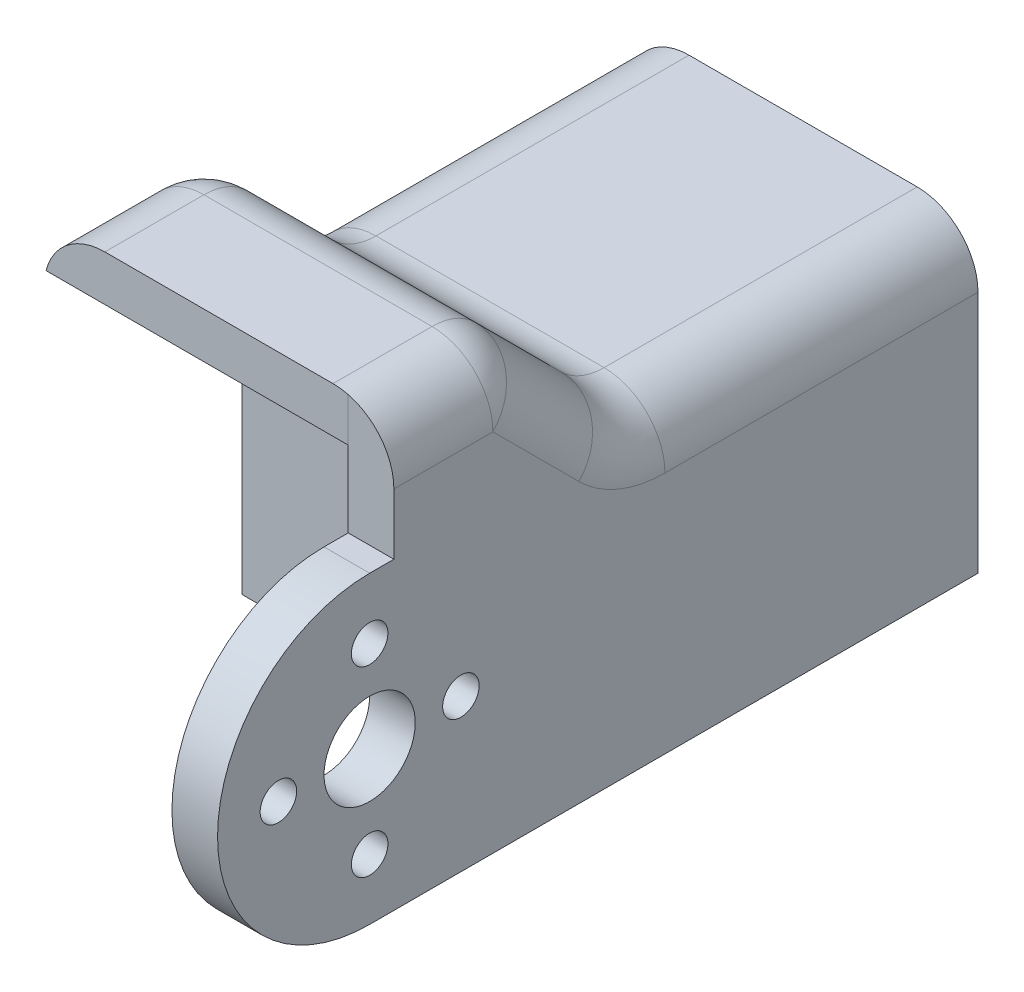
ISO-10303-21;
HEADER;
FILE_DESCRIPTION(('STEP AP214'),'2;1');
FILE_NAME('part.step','',(''),(''),'','','');
FILE_SCHEMA(('AUTOMOTIVE_DESIGN { 1 0 10303 214 1 1 1 1 }'));
ENDSEC;
DATA;
#1=APPLICATION_CONTEXT('core data for automotive mechanical design processes');
#2=APPLICATION_PROTOCOL_DEFINITION('international standard','automotive_design',2000,#1);
#3=PRODUCT_CONTEXT('',#1,'mechanical');
#4=PRODUCT('Part','Part','',(#3));
#5=PRODUCT_RELATED_PRODUCT_CATEGORY('part','',(#4));
#6=PRODUCT_DEFINITION_FORMATION('','',#4);
#7=PRODUCT_DEFINITION_CONTEXT('part definition',#1,'design');
#8=PRODUCT_DEFINITION('design','',#6,#7);
#9=PRODUCT_DEFINITION_SHAPE('','',#8);
#10=(LENGTH_UNIT() NAMED_UNIT(*) SI_UNIT(.MILLI.,.METRE.));
#11=(NAMED_UNIT(*) PLANE_ANGLE_UNIT() SI_UNIT($,.RADIAN.));
#12=(NAMED_UNIT(*) SI_UNIT($,.STERADIAN.) SOLID_ANGLE_UNIT());
#13=UNCERTAINTY_MEASURE_WITH_UNIT(LENGTH_MEASURE(1.E-05),#10,'distance_accuracy_value','');
#14=(GEOMETRIC_REPRESENTATION_CONTEXT(3) GLOBAL_UNCERTAINTY_ASSIGNED_CONTEXT((#13)) GLOBAL_UNIT_ASSIGNED_CONTEXT((#10,
#11,#12)) REPRESENTATION_CONTEXT('',''));
#15=CARTESIAN_POINT('',(0.,0.,0.));
#16=DIRECTION('',(0.,0.,1.));
#17=DIRECTION('',(1.,0.,0.));
#18=AXIS2_PLACEMENT_3D('',#15,#16,#17);
#19=CARTESIAN_POINT('',(52.,28.,-25.3));
#20=DIRECTION('',(1.,0.,0.));
#21=DIRECTION('',(0.,0.,-1.));
#22=AXIS2_PLACEMENT_3D('',#19,#20,#21);
#23=PLANE('',#22);
#24=CARTESIAN_POINT('',(52.,34.,-10.3));
#25=DIRECTION('',(1.,0.,0.));
#26=DIRECTION('',(0.,0.,-1.));
#27=AXIS2_PLACEMENT_3D('',#24,#25,#26);
#28=CIRCLE('',#27,1.19999999999999);
#29=CARTESIAN_POINT('',(52.,34.,-11.5));
#30=VERTEX_POINT('',#29);
#31=EDGE_CURVE('E492',#30,#30,#28,.T.);
#32=ORIENTED_EDGE('',*,*,#31,.T.);
#33=EDGE_LOOP('',(#32));
#34=FACE_BOUND('',#33,.T.);
#35=CARTESIAN_POINT('',(52.,28.,-16.3));
#36=DIRECTION('',(1.,0.,0.));
#37=DIRECTION('',(0.,0.,-1.));
#38=AXIS2_PLACEMENT_3D('',#35,#36,#37);
#39=CIRCLE('',#38,1.19999999999999);
#40=CARTESIAN_POINT('',(52.,28.,-17.5));
#41=VERTEX_POINT('',#40);
#42=EDGE_CURVE('E496',#41,#41,#39,.T.);
#43=ORIENTED_EDGE('',*,*,#42,.T.);
#44=EDGE_LOOP('',(#43));
#45=FACE_BOUND('',#44,.T.);
#46=CARTESIAN_POINT('',(52.,22.,-10.3));
#47=DIRECTION('',(1.,0.,0.));
#48=DIRECTION('',(0.,0.,-1.));
#49=AXIS2_PLACEMENT_3D('',#46,#47,#48);
#50=CIRCLE('',#49,1.19999999999999);
#51=CARTESIAN_POINT('',(52.,22.,-11.5));
#52=VERTEX_POINT('',#51);
#53=EDGE_CURVE('E500',#52,#52,#50,.T.);
#54=ORIENTED_EDGE('',*,*,#53,.T.);
#55=EDGE_LOOP('',(#54));
#56=FACE_BOUND('',#55,.T.);
#57=CARTESIAN_POINT('',(52.,28.,-4.3));
#58=DIRECTION('',(1.,0.,0.));
#59=DIRECTION('',(0.,0.,-1.));
#60=AXIS2_PLACEMENT_3D('',#57,#58,#59);
#61=CIRCLE('',#60,1.19999999999999);
#62=CARTESIAN_POINT('',(52.,28.,-5.49999999999999));
#63=VERTEX_POINT('',#62);
#64=EDGE_CURVE('E503',#63,#63,#61,.T.);
#65=ORIENTED_EDGE('',*,*,#64,.T.);
#66=EDGE_LOOP('',(#65));
#67=FACE_BOUND('',#66,.T.);
#68=DIRECTION('',(0.,-0.707106781186548,-0.707106781186548));
#69=VECTOR('',#68,1.);
#70=CARTESIAN_POINT('',(52.,33.4439026179069,-26.843170436707));
#71=LINE('',#70,#69);
#72=CARTESIAN_POINT('',(52.,43.,-17.287073054614));
#73=VERTEX_POINT('',#72);
#74=CARTESIAN_POINT('',(52.,35.3942687085069,-24.892804346107));
#75=VERTEX_POINT('',#74);
#76=EDGE_CURVE('E387',#73,#75,#71,.T.);
#77=ORIENTED_EDGE('',*,*,#76,.T.);
#78=DIRECTION('',(0.,-1.,0.));
#79=VECTOR('',#78,1.);
#80=CARTESIAN_POINT('',(52.,23.,-24.892804346107));
#81=LINE('',#80,#79);
#82=CARTESIAN_POINT('',(52.,18.,-24.892804346107));
#83=VERTEX_POINT('',#82);
#84=EDGE_CURVE('E224',#75,#83,#81,.T.);
#85=ORIENTED_EDGE('',*,*,#84,.T.);
#86=DIRECTION('',(0.,0.,1.));
#87=VECTOR('',#86,1.);
#88=CARTESIAN_POINT('',(52.,18.,-50.3));
#89=LINE('',#88,#87);
#90=CARTESIAN_POINT('',(52.,18.,-10.3));
#91=VERTEX_POINT('',#90);
#92=EDGE_CURVE('E48',#83,#91,#89,.T.);
#93=ORIENTED_EDGE('',*,*,#92,.T.);
#94=CARTESIAN_POINT('',(52.,28.,-10.3));
#95=DIRECTION('',(1.,0.,0.));
#96=DIRECTION('',(0.,1.,0.));
#97=AXIS2_PLACEMENT_3D('',#94,#95,#96);
#98=CIRCLE('',#97,10.);
#99=CARTESIAN_POINT('',(52.,38.,-10.3));
#100=VERTEX_POINT('',#99);
#101=EDGE_CURVE('E11',#100,#91,#98,.T.);
#102=ORIENTED_EDGE('',*,*,#101,.F.);
#103=DIRECTION('',(0.,0.,1.));
#104=VECTOR('',#103,1.);
#105=CARTESIAN_POINT('',(52.,38.,-50.3));
#106=LINE('',#105,#104);
#107=CARTESIAN_POINT('',(52.,38.,-11.8927546276539));
#108=VERTEX_POINT('',#107);
#109=EDGE_CURVE('E366',#108,#100,#106,.T.);
#110=ORIENTED_EDGE('',*,*,#109,.F.);
#111=DIRECTION('',(0.,1.,0.));
#112=VECTOR('',#111,1.);
#113=CARTESIAN_POINT('',(52.,38.,-11.8927546276539));
#114=LINE('',#113,#112);
#115=CARTESIAN_POINT('',(52.,45.8729833462074,-11.8927546276539));
#116=VERTEX_POINT('',#115);
#117=EDGE_CURVE('E365',#108,#116,#114,.T.);
#118=ORIENTED_EDGE('',*,*,#117,.T.);
#119=DIRECTION('',(0.,0.,1.));
#120=VECTOR('',#119,1.);
#121=CARTESIAN_POINT('',(52.,45.8729833462074,-22.637877313827));
#122=LINE('',#121,#120);
#123=CARTESIAN_POINT('',(52.,45.8729833462074,-11.8928043461071));
#124=VERTEX_POINT('',#123);
#125=EDGE_CURVE('E352',#124,#116,#122,.T.);
#126=ORIENTED_EDGE('',*,*,#125,.F.);
#127=DIRECTION('',(0.,-1.,0.));
#128=VECTOR('',#127,1.);
#129=CARTESIAN_POINT('',(52.,36.25,-11.8928043461071));
#130=LINE('',#129,#128);
#131=CARTESIAN_POINT('',(52.,43.,-11.892804346107));
#132=VERTEX_POINT('',#131);
#133=EDGE_CURVE('E399',#124,#132,#130,.T.);
#134=ORIENTED_EDGE('',*,*,#133,.T.);
#135=DIRECTION('',(0.,0.,-1.));
#136=VECTOR('',#135,1.);
#137=CARTESIAN_POINT('',(52.,43.,-25.0964021730535));
#138=LINE('',#137,#136);
#139=EDGE_CURVE('E392',#132,#73,#138,.T.);
#140=ORIENTED_EDGE('',*,*,#139,.T.);
#141=EDGE_LOOP('',(#77,#85,#93,#102,#110,#118,#126,#134,#140));
#142=FACE_BOUND('',#141,.T.);
#143=CARTESIAN_POINT('',(52.,28.,-10.3));
#144=DIRECTION('',(-1.,0.,0.));
#145=DIRECTION('',(0.,1.,0.));
#146=AXIS2_PLACEMENT_3D('',#143,#144,#145);
#147=CIRCLE('',#146,3.);
#148=CARTESIAN_POINT('',(52.,31.,-10.3));
#149=VERTEX_POINT('',#148);
#150=EDGE_CURVE('E418',#149,#149,#147,.T.);
#151=ORIENTED_EDGE('',*,*,#150,.F.);
#152=EDGE_LOOP('',(#151));
#153=FACE_BOUND('',#152,.T.);
#154=ADVANCED_FACE('F39',(#34,#45,#56,#67,#142,#153),#23,.F.);
#155=CARTESIAN_POINT('',(52.,28.,-10.3));
#156=DIRECTION('',(1.,0.,0.));
#157=DIRECTION('',(0.,1.,0.));
#158=AXIS2_PLACEMENT_3D('',#155,#156,#157);
#159=CYLINDRICAL_SURFACE('',#158,10.);
#160=ORIENTED_EDGE('',*,*,#101,.T.);
#161=DIRECTION('',(1.,0.,0.));
#162=VECTOR('',#161,1.);
#163=CARTESIAN_POINT('',(52.,18.,-10.3));
#164=LINE('',#163,#162);
#165=CARTESIAN_POINT('',(55.,18.,-10.3));
#166=VERTEX_POINT('',#165);
#167=EDGE_CURVE('E217',#91,#166,#164,.T.);
#168=ORIENTED_EDGE('',*,*,#167,.T.);
#169=CARTESIAN_POINT('',(55.,28.,-10.3));
#170=DIRECTION('',(1.,0.,0.));
#171=DIRECTION('',(0.,1.,0.));
#172=AXIS2_PLACEMENT_3D('',#169,#170,#171);
#173=CIRCLE('',#172,10.);
#174=CARTESIAN_POINT('',(55.,38.,-10.3));
#175=VERTEX_POINT('',#174);
#176=EDGE_CURVE('E221',#175,#166,#173,.T.);
#177=ORIENTED_EDGE('',*,*,#176,.F.);
#178=DIRECTION('',(1.,0.,0.));
#179=VECTOR('',#178,1.);
#180=CARTESIAN_POINT('',(52.,38.,-10.3));
#181=LINE('',#180,#179);
#182=EDGE_CURVE('E370',#100,#175,#181,.T.);
#183=ORIENTED_EDGE('',*,*,#182,.F.);
#184=EDGE_LOOP('',(#160,#168,#177,#183));
#185=FACE_BOUND('',#184,.T.);
#186=ADVANCED_FACE('F219',(#185),#159,.T.);
#187=CARTESIAN_POINT('',(52.,18.,-10.3));
#188=DIRECTION('',(0.,-1.,0.));
#189=DIRECTION('',(-1.,0.,0.));
#190=AXIS2_PLACEMENT_3D('',#187,#188,#189);
#191=PLANE('',#190);
#192=ORIENTED_EDGE('',*,*,#92,.F.);
#193=DIRECTION('',(-1.,0.,0.));
#194=VECTOR('',#193,1.);
#195=CARTESIAN_POINT('',(52.,18.,-24.892804346107));
#196=LINE('',#195,#194);
#197=CARTESIAN_POINT('',(32.,18.,-24.892804346107));
#198=VERTEX_POINT('',#197);
#199=EDGE_CURVE('E403',#83,#198,#196,.T.);
#200=ORIENTED_EDGE('',*,*,#199,.T.);
#201=DIRECTION('',(0.,0.,1.));
#202=VECTOR('',#201,1.);
#203=CARTESIAN_POINT('',(32.,18.,-50.3));
#204=LINE('',#203,#202);
#205=CARTESIAN_POINT('',(32.,18.,-50.3));
#206=VERTEX_POINT('',#205);
#207=EDGE_CURVE('E378',#206,#198,#204,.T.);
#208=ORIENTED_EDGE('',*,*,#207,.F.);
#209=DIRECTION('',(-1.,0.,0.));
#210=VECTOR('',#209,1.);
#211=CARTESIAN_POINT('',(52.,18.,-50.3));
#212=LINE('',#211,#210);
#213=CARTESIAN_POINT('',(55.,18.,-50.3));
#214=VERTEX_POINT('',#213);
#215=EDGE_CURVE('E230',#214,#206,#212,.T.);
#216=ORIENTED_EDGE('',*,*,#215,.F.);
#217=DIRECTION('',(0.,0.,-1.));
#218=VECTOR('',#217,1.);
#219=CARTESIAN_POINT('',(55.,18.,-50.3));
#220=LINE('',#219,#218);
#221=EDGE_CURVE('E227',#166,#214,#220,.T.);
#222=ORIENTED_EDGE('',*,*,#221,.F.);
#223=ORIENTED_EDGE('',*,*,#167,.F.);
#224=EDGE_LOOP('',(#192,#200,#208,#216,#222,#223));
#225=FACE_BOUND('',#224,.T.);
#226=ADVANCED_FACE('F228',(#225),#191,.T.);
#227=CARTESIAN_POINT('',(52.,18.,-24.892804346107));
#228=DIRECTION('',(0.,0.,1.));
#229=DIRECTION('',(1.,0.,0.));
#230=AXIS2_PLACEMENT_3D('',#227,#228,#229);
#231=PLANE('',#230);
#232=DIRECTION('',(-1.,0.,0.));
#233=VECTOR('',#232,1.);
#234=CARTESIAN_POINT('',(52.,35.3942687085069,-24.8928043461071));
#235=LINE('',#234,#233);
#236=CARTESIAN_POINT('',(32.,35.3942687085069,-24.892804346107));
#237=VERTEX_POINT('',#236);
#238=EDGE_CURVE('E268',#75,#237,#235,.T.);
#239=ORIENTED_EDGE('',*,*,#238,.T.);
#240=DIRECTION('',(0.,1.,0.));
#241=VECTOR('',#240,1.);
#242=CARTESIAN_POINT('',(32.,38.,-24.892804346107));
#243=LINE('',#242,#241);
#244=EDGE_CURVE('E269',#198,#237,#243,.T.);
#245=ORIENTED_EDGE('',*,*,#244,.F.);
#246=ORIENTED_EDGE('',*,*,#199,.F.);
#247=ORIENTED_EDGE('',*,*,#84,.F.);
#248=EDGE_LOOP('',(#239,#245,#246,#247));
#249=FACE_BOUND('',#248,.T.);
#250=ADVANCED_FACE('F473',(#249),#231,.T.);
#251=CARTESIAN_POINT('',(52.,38.,-50.3));
#252=DIRECTION('',(0.,1.,0.));
#253=DIRECTION('',(0.,0.,-1.));
#254=AXIS2_PLACEMENT_3D('',#251,#252,#253);
#255=PLANE('',#254);
#256=DIRECTION('',(-1.,0.,0.));
#257=VECTOR('',#256,1.);
#258=CARTESIAN_POINT('',(52.,38.,-11.8927546276539));
#259=LINE('',#258,#257);
#260=CARTESIAN_POINT('',(55.,38.,-11.8927546276539));
#261=VERTEX_POINT('',#260);
#262=EDGE_CURVE('E374',#261,#108,#259,.T.);
#263=ORIENTED_EDGE('',*,*,#262,.T.);
#264=ORIENTED_EDGE('',*,*,#109,.T.);
#265=ORIENTED_EDGE('',*,*,#182,.T.);
#266=DIRECTION('',(0.,0.,1.));
#267=VECTOR('',#266,1.);
#268=CARTESIAN_POINT('',(55.,38.,-50.3));
#269=LINE('',#268,#267);
#270=EDGE_CURVE('E241',#261,#175,#269,.T.);
#271=ORIENTED_EDGE('',*,*,#270,.F.);
#272=EDGE_LOOP('',(#263,#264,#265,#271));
#273=FACE_BOUND('',#272,.T.);
#274=ADVANCED_FACE('F470',(#273),#255,.T.);
#275=CARTESIAN_POINT('',(43.5,46.,-19.9757546276539));
#276=DIRECTION('',(0.,1.,0.));
#277=DIRECTION('',(1.,0.,0.));
#278=AXIS2_PLACEMENT_3D('',#275,#276,#277);
#279=PLANE('',#278);
#280=DIRECTION('',(0.,0.,-1.));
#281=VECTOR('',#280,1.);
#282=CARTESIAN_POINT('',(36.,46.,-28.7860784003537));
#283=LINE('',#282,#281);
#284=CARTESIAN_POINT('',(36.,46.,-11.892804346107));
#285=VERTEX_POINT('',#284);
#286=CARTESIAN_POINT('',(36.,46.,-18.4019003781615));
#287=VERTEX_POINT('',#286);
#288=EDGE_CURVE('E253',#285,#287,#283,.T.);
#289=ORIENTED_EDGE('',*,*,#288,.F.);
#290=DIRECTION('',(-1.,0.,0.));
#291=VECTOR('',#290,1.);
#292=CARTESIAN_POINT('',(52.,46.,-11.8928043461071));
#293=LINE('',#292,#291);
#294=CARTESIAN_POINT('',(51.,46.,-11.8928043461071));
#295=VERTEX_POINT('',#294);
#296=EDGE_CURVE('E371',#295,#285,#293,.T.);
#297=ORIENTED_EDGE('',*,*,#296,.F.);
#298=DIRECTION('',(0.,0.,1.));
#299=VECTOR('',#298,1.);
#300=CARTESIAN_POINT('',(51.,46.,-22.637877313827));
#301=LINE('',#300,#299);
#302=CARTESIAN_POINT('',(51.,46.,-18.4019003781615));
#303=VERTEX_POINT('',#302);
#304=EDGE_CURVE('E344',#303,#295,#301,.T.);
#305=ORIENTED_EDGE('',*,*,#304,.F.);
#306=DIRECTION('',(1.,0.,0.));
#307=VECTOR('',#306,1.);
#308=CARTESIAN_POINT('',(37.75,46.,-18.4019003781615));
#309=LINE('',#308,#307);
#310=EDGE_CURVE('E515',#287,#303,#309,.T.);
#311=ORIENTED_EDGE('',*,*,#310,.F.);
#312=EDGE_LOOP('',(#289,#297,#305,#311));
#313=FACE_BOUND('',#312,.T.);
#314=ADVANCED_FACE('F472',(#313),#279,.T.);
#315=CARTESIAN_POINT('',(42.,44.5,-11.892804346107));
#316=DIRECTION('',(0.,0.,1.));
#317=DIRECTION('',(1.,0.,0.));
#318=AXIS2_PLACEMENT_3D('',#315,#316,#317);
#319=PLANE('',#318);
#320=CARTESIAN_POINT('',(36.,42.,-11.892804346107));
#321=DIRECTION('',(0.,0.,-1.));
#322=DIRECTION('',(-0.707106781186547,0.707106781186548,0.));
#323=AXIS2_PLACEMENT_3D('',#320,#321,#322);
#324=CIRCLE('',#323,4.);
#325=CARTESIAN_POINT('',(32.1270166537926,43.,-11.892804346107));
#326=VERTEX_POINT('',#325);
#327=EDGE_CURVE('E251',#326,#285,#324,.T.);
#328=ORIENTED_EDGE('',*,*,#327,.F.);
#329=DIRECTION('',(1.,0.,0.));
#330=VECTOR('',#329,1.);
#331=CARTESIAN_POINT('',(52.,43.,-11.892804346107));
#332=LINE('',#331,#330);
#333=EDGE_CURVE('E395',#326,#132,#332,.T.);
#334=ORIENTED_EDGE('',*,*,#333,.T.);
#335=ORIENTED_EDGE('',*,*,#133,.F.);
#336=CARTESIAN_POINT('',(51.,42.,-11.8928043461071));
#337=DIRECTION('',(0.,0.,-1.));
#338=DIRECTION('',(0.707106781186548,0.707106781186548,0.));
#339=AXIS2_PLACEMENT_3D('',#336,#337,#338);
#340=CIRCLE('',#339,4.);
#341=EDGE_CURVE('E348',#295,#124,#340,.T.);
#342=ORIENTED_EDGE('',*,*,#341,.F.);
#343=ORIENTED_EDGE('',*,*,#296,.T.);
#344=EDGE_LOOP('',(#328,#334,#335,#342,#343));
#345=FACE_BOUND('',#344,.T.);
#346=ADVANCED_FACE('F479',(#345),#319,.T.);
#347=CARTESIAN_POINT('',(32.,43.,-24.892804346107));
#348=DIRECTION('',(0.,-1.,0.));
#349=DIRECTION('',(0.,0.,-1.));
#350=AXIS2_PLACEMENT_3D('',#347,#348,#349);
#351=PLANE('',#350);
#352=DIRECTION('',(0.,0.,1.));
#353=VECTOR('',#352,1.);
#354=CARTESIAN_POINT('',(32.1270166537926,43.,-28.7860784003537));
#355=LINE('',#354,#353);
#356=CARTESIAN_POINT('',(32.1270166537926,43.,-17.287073054614));
#357=VERTEX_POINT('',#356);
#358=EDGE_CURVE('E320',#357,#326,#355,.T.);
#359=ORIENTED_EDGE('',*,*,#358,.F.);
#360=DIRECTION('',(1.,0.,0.));
#361=VECTOR('',#360,1.);
#362=CARTESIAN_POINT('',(42.,43.,-17.287073054614));
#363=LINE('',#362,#361);
#364=EDGE_CURVE('E388',#357,#73,#363,.T.);
#365=ORIENTED_EDGE('',*,*,#364,.T.);
#366=ORIENTED_EDGE('',*,*,#139,.F.);
#367=ORIENTED_EDGE('',*,*,#333,.F.);
#368=EDGE_LOOP('',(#359,#365,#366,#367));
#369=FACE_BOUND('',#368,.T.);
#370=ADVANCED_FACE('F583',(#369),#351,.T.);
#371=CARTESIAN_POINT('',(52.,35.3942687085069,-24.892804346107));
#372=DIRECTION('',(0.,-0.707106781186548,0.707106781186548));
#373=DIRECTION('',(-1.,0.,0.));
#374=AXIS2_PLACEMENT_3D('',#371,#372,#373);
#375=PLANE('',#374);
#376=CARTESIAN_POINT('',(36.,42.,-18.287073054614));
#377=DIRECTION('',(0.,0.707106781186548,-0.707106781186548));
#378=DIRECTION('',(0.,0.707106781186548,0.707106781186548));
#379=AXIS2_PLACEMENT_3D('',#376,#377,#378);
#380=ELLIPSE('',#379,5.65685424949238,4.);
#381=CARTESIAN_POINT('',(32.,42.,-18.287073054614));
#382=VERTEX_POINT('',#381);
#383=EDGE_CURVE('E316',#382,#357,#380,.T.);
#384=ORIENTED_EDGE('',*,*,#383,.F.);
#385=DIRECTION('',(0.,0.707106781186548,0.707106781186548));
#386=VECTOR('',#385,1.);
#387=CARTESIAN_POINT('',(32.,43.,-17.287073054614));
#388=LINE('',#387,#386);
#389=EDGE_CURVE('E265',#237,#382,#388,.T.);
#390=ORIENTED_EDGE('',*,*,#389,.F.);
#391=ORIENTED_EDGE('',*,*,#238,.F.);
#392=ORIENTED_EDGE('',*,*,#76,.F.);
#393=ORIENTED_EDGE('',*,*,#364,.F.);
#394=EDGE_LOOP('',(#384,#390,#391,#392,#393));
#395=FACE_BOUND('',#394,.T.);
#396=ADVANCED_FACE('F588',(#395),#375,.T.);
#397=CARTESIAN_POINT('',(32.,28.,-37.5964021730535));
#398=DIRECTION('',(-1.,0.,0.));
#399=DIRECTION('',(0.,1.,0.));
#400=AXIS2_PLACEMENT_3D('',#397,#398,#399);
#401=PLANE('',#400);
#402=DIRECTION('',(0.,0.,1.));
#403=VECTOR('',#402,1.);
#404=CARTESIAN_POINT('',(32.,34.,-43.9482010865268));
#405=LINE('',#404,#403);
#406=CARTESIAN_POINT('',(32.,34.,-50.3));
#407=VERTEX_POINT('',#406);
#408=CARTESIAN_POINT('',(32.,34.,-29.7156088771462));
#409=VERTEX_POINT('',#408);
#410=EDGE_CURVE('E275',#407,#409,#405,.T.);
#411=ORIENTED_EDGE('',*,*,#410,.F.);
#412=DIRECTION('',(0.,-1.,0.));
#413=VECTOR('',#412,1.);
#414=CARTESIAN_POINT('',(32.,38.,-50.3));
#415=LINE('',#414,#413);
#416=EDGE_CURVE('E361',#407,#206,#415,.T.);
#417=ORIENTED_EDGE('',*,*,#416,.T.);
#418=ORIENTED_EDGE('',*,*,#207,.T.);
#419=ORIENTED_EDGE('',*,*,#244,.T.);
#420=ORIENTED_EDGE('',*,*,#389,.T.);
#421=DIRECTION('',(0.,0.,1.));
#422=VECTOR('',#421,1.);
#423=CARTESIAN_POINT('',(32.,42.,-28.7860784003537));
#424=LINE('',#423,#422);
#425=CARTESIAN_POINT('',(32.,42.,-18.4019003781615));
#426=VERTEX_POINT('',#425);
#427=EDGE_CURVE('E315',#426,#382,#424,.T.);
#428=ORIENTED_EDGE('',*,*,#427,.F.);
#429=DIRECTION('',(0.,0.707106781186547,0.707106781186548));
#430=VECTOR('',#429,1.);
#431=CARTESIAN_POINT('',(32.,34.2871609889038,-26.1147393892576));
#432=LINE('',#431,#430);
#433=CARTESIAN_POINT('',(32.,36.3431457505076,-24.0587546276539));
#434=VERTEX_POINT('',#433);
#435=EDGE_CURVE('E274',#434,#426,#432,.T.);
#436=ORIENTED_EDGE('',*,*,#435,.F.);
#437=CARTESIAN_POINT('',(32.,42.,-29.7156088771462));
#438=DIRECTION('',(-1.,0.,0.));
#439=DIRECTION('',(0.,-0.923879532511287,0.38268343236509));
#440=AXIS2_PLACEMENT_3D('',#437,#438,#439);
#441=CIRCLE('',#440,8.);
#442=EDGE_CURVE('E260',#409,#434,#441,.T.);
#443=ORIENTED_EDGE('',*,*,#442,.F.);
#444=EDGE_LOOP('',(#411,#417,#418,#419,#420,#428,#436,#443));
#445=FACE_BOUND('',#444,.T.);
#446=ADVANCED_FACE('F573',(#445),#401,.T.);
#447=CARTESIAN_POINT('',(32.,46.,-20.0587546276538));
#448=DIRECTION('',(0.,-0.707106781186548,0.707106781186547));
#449=DIRECTION('',(-1.,0.,0.));
#450=AXIS2_PLACEMENT_3D('',#447,#448,#449);
#451=PLANE('',#450);
#452=DIRECTION('',(0.,0.707106781186547,0.707106781186548));
#453=VECTOR('',#452,1.);
#454=CARTESIAN_POINT('',(51.,40.1896886569134,-25.8690659707404));
#455=LINE('',#454,#453);
#456=CARTESIAN_POINT('',(51.,39.1715728752538,-26.8871817524001));
#457=VERTEX_POINT('',#456);
#458=CARTESIAN_POINT('',(51.,44.8284271247461,-21.2303275029077));
#459=VERTEX_POINT('',#458);
#460=EDGE_CURVE('E292',#457,#459,#455,.T.);
#461=ORIENTED_EDGE('',*,*,#460,.F.);
#462=DIRECTION('',(1.,0.,0.));
#463=VECTOR('',#462,1.);
#464=CARTESIAN_POINT('',(42.,39.1715728752538,-26.8871817524001));
#465=LINE('',#464,#463);
#466=CARTESIAN_POINT('',(36.,39.1715728752538,-26.8871817524));
#467=VERTEX_POINT('',#466);
#468=EDGE_CURVE('E340',#467,#457,#465,.T.);
#469=ORIENTED_EDGE('',*,*,#468,.F.);
#470=DIRECTION('',(0.,-0.707106781186547,-0.707106781186548));
#471=VECTOR('',#470,1.);
#472=CARTESIAN_POINT('',(36.,37.11558811365,-28.9431665140038));
#473=LINE('',#472,#471);
#474=CARTESIAN_POINT('',(36.,44.8284271247461,-21.2303275029077));
#475=VERTEX_POINT('',#474);
#476=EDGE_CURVE('E333',#475,#467,#473,.T.);
#477=ORIENTED_EDGE('',*,*,#476,.F.);
#478=DIRECTION('',(-1.,0.,0.));
#479=VECTOR('',#478,1.);
#480=CARTESIAN_POINT('',(37.75,44.8284271247461,-21.2303275029077));
#481=LINE('',#480,#479);
#482=EDGE_CURVE('E427',#459,#475,#481,.T.);
#483=ORIENTED_EDGE('',*,*,#482,.F.);
#484=EDGE_LOOP('',(#461,#469,#477,#483));
#485=FACE_BOUND('',#484,.T.);
#486=ADVANCED_FACE('F562',(#485),#451,.F.);
#487=CARTESIAN_POINT('',(52.,38.,-11.8927546276539));
#488=DIRECTION('',(0.,0.,1.));
#489=DIRECTION('',(1.,0.,0.));
#490=AXIS2_PLACEMENT_3D('',#487,#488,#489);
#491=PLANE('',#490);
#492=CARTESIAN_POINT('',(51.,42.,-11.8927546276539));
#493=DIRECTION('',(0.,0.,-1.));
#494=DIRECTION('',(0.707106781186548,0.707106781186548,0.));
#495=AXIS2_PLACEMENT_3D('',#492,#493,#494);
#496=CIRCLE('',#495,4.);
#497=CARTESIAN_POINT('',(55.,42.,-11.8927546276539));
#498=VERTEX_POINT('',#497);
#499=EDGE_CURVE('E341',#116,#498,#496,.T.);
#500=ORIENTED_EDGE('',*,*,#499,.F.);
#501=ORIENTED_EDGE('',*,*,#117,.F.);
#502=ORIENTED_EDGE('',*,*,#262,.F.);
#503=DIRECTION('',(0.,1.,0.));
#504=VECTOR('',#503,1.);
#505=CARTESIAN_POINT('',(55.,38.,-11.8927546276539));
#506=LINE('',#505,#504);
#507=EDGE_CURVE('E247',#261,#498,#506,.T.);
#508=ORIENTED_EDGE('',*,*,#507,.T.);
#509=EDGE_LOOP('',(#500,#501,#502,#508));
#510=FACE_BOUND('',#509,.T.);
#511=ADVANCED_FACE('F459',(#510),#491,.T.);
#512=CARTESIAN_POINT('',(52.,18.,-50.3));
#513=DIRECTION('',(0.,0.,-1.));
#514=DIRECTION('',(-1.,0.,0.));
#515=AXIS2_PLACEMENT_3D('',#512,#513,#514);
#516=PLANE('',#515);
#517=CARTESIAN_POINT('',(51.,34.,-50.3));
#518=DIRECTION('',(0.,0.,1.));
#519=DIRECTION('',(0.707106781186548,0.707106781186548,0.));
#520=AXIS2_PLACEMENT_3D('',#517,#518,#519);
#521=CIRCLE('',#520,4.);
#522=CARTESIAN_POINT('',(55.,34.,-50.3));
#523=VERTEX_POINT('',#522);
#524=CARTESIAN_POINT('',(51.,38.,-50.3));
#525=VERTEX_POINT('',#524);
#526=EDGE_CURVE('E296',#523,#525,#521,.T.);
#527=ORIENTED_EDGE('',*,*,#526,.F.);
#528=DIRECTION('',(0.,1.,0.));
#529=VECTOR('',#528,1.);
#530=CARTESIAN_POINT('',(55.,18.,-50.3));
#531=LINE('',#530,#529);
#532=EDGE_CURVE('E235',#214,#523,#531,.T.);
#533=ORIENTED_EDGE('',*,*,#532,.F.);
#534=ORIENTED_EDGE('',*,*,#215,.T.);
#535=ORIENTED_EDGE('',*,*,#416,.F.);
#536=CARTESIAN_POINT('',(36.,34.,-50.3));
#537=DIRECTION('',(0.,0.,1.));
#538=DIRECTION('',(-0.707106781186547,0.707106781186548,0.));
#539=AXIS2_PLACEMENT_3D('',#536,#537,#538);
#540=CIRCLE('',#539,4.);
#541=CARTESIAN_POINT('',(36.,38.,-50.3));
#542=VERTEX_POINT('',#541);
#543=EDGE_CURVE('E325',#542,#407,#540,.T.);
#544=ORIENTED_EDGE('',*,*,#543,.F.);
#545=DIRECTION('',(1.,0.,0.));
#546=VECTOR('',#545,1.);
#547=CARTESIAN_POINT('',(52.,38.,-50.3));
#548=LINE('',#547,#546);
#549=EDGE_CURVE('E356',#542,#525,#548,.T.);
#550=ORIENTED_EDGE('',*,*,#549,.T.);
#551=EDGE_LOOP('',(#527,#533,#534,#535,#544,#550));
#552=FACE_BOUND('',#551,.T.);
#553=ADVANCED_FACE('F591',(#552),#516,.T.);
#554=CARTESIAN_POINT('',(52.,38.,-50.3));
#555=DIRECTION('',(0.,1.,0.));
#556=DIRECTION('',(0.,0.,-1.));
#557=AXIS2_PLACEMENT_3D('',#554,#555,#556);
#558=PLANE('',#557);
#559=DIRECTION('',(0.,0.,-1.));
#560=VECTOR('',#559,1.);
#561=CARTESIAN_POINT('',(36.,38.,-43.9482010865268));
#562=LINE('',#561,#560);
#563=CARTESIAN_POINT('',(36.,38.,-29.7156088771462));
#564=VERTEX_POINT('',#563);
#565=EDGE_CURVE('E270',#564,#542,#562,.T.);
#566=ORIENTED_EDGE('',*,*,#565,.F.);
#567=DIRECTION('',(-1.,0.,0.));
#568=VECTOR('',#567,1.);
#569=CARTESIAN_POINT('',(42.,38.,-29.7156088771462));
#570=LINE('',#569,#568);
#571=CARTESIAN_POINT('',(51.,38.,-29.7156088771462));
#572=VERTEX_POINT('',#571);
#573=EDGE_CURVE('E337',#572,#564,#570,.T.);
#574=ORIENTED_EDGE('',*,*,#573,.F.);
#575=DIRECTION('',(0.,0.,1.));
#576=VECTOR('',#575,1.);
#577=CARTESIAN_POINT('',(51.,38.,-37.8));
#578=LINE('',#577,#576);
#579=EDGE_CURVE('E300',#525,#572,#578,.T.);
#580=ORIENTED_EDGE('',*,*,#579,.F.);
#581=ORIENTED_EDGE('',*,*,#549,.F.);
#582=EDGE_LOOP('',(#566,#574,#580,#581));
#583=FACE_BOUND('',#582,.T.);
#584=ADVANCED_FACE('F608',(#583),#558,.T.);
#585=CARTESIAN_POINT('',(51.,42.,-22.637877313827));
#586=DIRECTION('',(0.,0.,-1.));
#587=DIRECTION('',(0.707106781186548,0.707106781186548,0.));
#588=AXIS2_PLACEMENT_3D('',#585,#586,#587);
#589=CYLINDRICAL_SURFACE('',#588,4.);
#590=ORIENTED_EDGE('',*,*,#499,.T.);
#591=DIRECTION('',(0.,0.,-1.));
#592=VECTOR('',#591,1.);
#593=CARTESIAN_POINT('',(55.,42.,-22.637877313827));
#594=LINE('',#593,#592);
#595=CARTESIAN_POINT('',(55.,42.,-18.4019003781615));
#596=VERTEX_POINT('',#595);
#597=EDGE_CURVE('E450',#498,#596,#594,.T.);
#598=ORIENTED_EDGE('',*,*,#597,.T.);
#599=CARTESIAN_POINT('',(51.,42.,-18.4019003781615));
#600=DIRECTION('',(0.,0.,1.));
#601=DIRECTION('',(1.,0.,0.));
#602=AXIS2_PLACEMENT_3D('',#599,#600,#601);
#603=CIRCLE('',#602,4.);
#604=EDGE_CURVE('E264',#596,#303,#603,.T.);
#605=ORIENTED_EDGE('',*,*,#604,.T.);
#606=ORIENTED_EDGE('',*,*,#304,.T.);
#607=ORIENTED_EDGE('',*,*,#341,.T.);
#608=ORIENTED_EDGE('',*,*,#125,.T.);
#609=EDGE_LOOP('',(#590,#598,#605,#606,#607,#608));
#610=FACE_BOUND('',#609,.T.);
#611=ADVANCED_FACE('F464',(#610),#589,.T.);
#612=CARTESIAN_POINT('',(42.,42.,-29.7156088771462));
#613=DIRECTION('',(1.,0.,0.));
#614=DIRECTION('',(0.,-0.923879532511287,0.38268343236509));
#615=AXIS2_PLACEMENT_3D('',#612,#613,#614);
#616=CYLINDRICAL_SURFACE('',#615,4.);
#617=CARTESIAN_POINT('',(51.,42.,-29.7156088771462));
#618=DIRECTION('',(1.,0.,0.));
#619=DIRECTION('',(0.,-0.707106781186548,0.707106781186547));
#620=AXIS2_PLACEMENT_3D('',#617,#618,#619);
#621=CIRCLE('',#620,4.);
#622=EDGE_CURVE('E280',#457,#572,#621,.T.);
#623=ORIENTED_EDGE('',*,*,#622,.T.);
#624=ORIENTED_EDGE('',*,*,#573,.T.);
#625=CARTESIAN_POINT('',(36.,42.,-29.7156088771462));
#626=DIRECTION('',(-1.,0.,0.));
#627=DIRECTION('',(0.,-1.,0.));
#628=AXIS2_PLACEMENT_3D('',#625,#626,#627);
#629=CIRCLE('',#628,4.);
#630=EDGE_CURVE('E261',#564,#467,#629,.T.);
#631=ORIENTED_EDGE('',*,*,#630,.T.);
#632=ORIENTED_EDGE('',*,*,#468,.T.);
#633=EDGE_LOOP('',(#623,#624,#631,#632));
#634=FACE_BOUND('',#633,.T.);
#635=ADVANCED_FACE('F599',(#634),#616,.F.);
#636=CARTESIAN_POINT('',(36.,34.2871609889038,-26.1147393892576));
#637=DIRECTION('',(0.,-0.707106781186548,-0.707106781186548));
#638=DIRECTION('',(-0.707106781186547,0.5,-0.5));
#639=AXIS2_PLACEMENT_3D('',#636,#637,#638);
#640=CYLINDRICAL_SURFACE('',#639,4.);
#641=CARTESIAN_POINT('',(36.,36.3431457505076,-24.0587546276539));
#642=DIRECTION('',(0.,0.707106781186548,0.707106781186548));
#643=DIRECTION('',(0.,0.707106781186548,-0.707106781186548));
#644=AXIS2_PLACEMENT_3D('',#641,#642,#643);
#645=CIRCLE('',#644,4.);
#646=EDGE_CURVE('E321',#467,#434,#645,.T.);
#647=ORIENTED_EDGE('',*,*,#646,.T.);
#648=ORIENTED_EDGE('',*,*,#435,.T.);
#649=CARTESIAN_POINT('',(36.,42.,-18.4019003781615));
#650=DIRECTION('',(0.,-0.707106781186547,-0.707106781186548));
#651=DIRECTION('',(-1.,0.,0.));
#652=AXIS2_PLACEMENT_3D('',#649,#650,#651);
#653=CIRCLE('',#652,4.);
#654=EDGE_CURVE('E301',#426,#475,#653,.T.);
#655=ORIENTED_EDGE('',*,*,#654,.T.);
#656=ORIENTED_EDGE('',*,*,#476,.T.);
#657=EDGE_LOOP('',(#647,#648,#655,#656));
#658=FACE_BOUND('',#657,.T.);
#659=ADVANCED_FACE('F567',(#658),#640,.T.);
#660=CARTESIAN_POINT('',(36.,34.,-43.9482010865268));
#661=DIRECTION('',(0.,0.,-1.));
#662=DIRECTION('',(-0.707106781186547,0.707106781186548,0.));
#663=AXIS2_PLACEMENT_3D('',#660,#661,#662);
#664=CYLINDRICAL_SURFACE('',#663,4.);
#665=ORIENTED_EDGE('',*,*,#543,.T.);
#666=ORIENTED_EDGE('',*,*,#410,.T.);
#667=CARTESIAN_POINT('',(36.,34.,-29.7156088771462));
#668=DIRECTION('',(0.,0.,-1.));
#669=DIRECTION('',(-1.,0.,0.));
#670=AXIS2_PLACEMENT_3D('',#667,#668,#669);
#671=CIRCLE('',#670,4.);
#672=EDGE_CURVE('E256',#409,#564,#671,.T.);
#673=ORIENTED_EDGE('',*,*,#672,.T.);
#674=ORIENTED_EDGE('',*,*,#565,.T.);
#675=EDGE_LOOP('',(#665,#666,#673,#674));
#676=FACE_BOUND('',#675,.T.);
#677=ADVANCED_FACE('F606',(#676),#664,.T.);
#678=CARTESIAN_POINT('',(36.,42.,-29.7156088771462));
#679=DIRECTION('',(1.,0.,0.));
#680=DIRECTION('',(0.,0.,-1.));
#681=AXIS2_PLACEMENT_3D('',#678,#679,#680);
#682=TOROIDAL_SURFACE('',#681,8.,4.);
#683=ORIENTED_EDGE('',*,*,#630,.F.);
#684=ORIENTED_EDGE('',*,*,#672,.F.);
#685=ORIENTED_EDGE('',*,*,#442,.T.);
#686=ORIENTED_EDGE('',*,*,#646,.F.);
#687=EDGE_LOOP('',(#683,#684,#685,#686));
#688=FACE_BOUND('',#687,.T.);
#689=ADVANCED_FACE('F604',(#688),#682,.T.);
#690=CARTESIAN_POINT('',(37.75,42.,-18.4019003781615));
#691=DIRECTION('',(-1.,0.,0.));
#692=DIRECTION('',(0.,0.923879532511287,-0.382683432365089));
#693=AXIS2_PLACEMENT_3D('',#690,#691,#692);
#694=CYLINDRICAL_SURFACE('',#693,4.);
#695=CARTESIAN_POINT('',(36.,42.,-18.4019003781615));
#696=DIRECTION('',(1.,0.,0.));
#697=DIRECTION('',(0.,0.707106781186548,-0.707106781186547));
#698=AXIS2_PLACEMENT_3D('',#695,#696,#697);
#699=CIRCLE('',#698,4.);
#700=EDGE_CURVE('E254',#475,#287,#699,.T.);
#701=ORIENTED_EDGE('',*,*,#700,.T.);
#702=ORIENTED_EDGE('',*,*,#310,.T.);
#703=CARTESIAN_POINT('',(51.,42.,-18.4019003781615));
#704=DIRECTION('',(-1.,0.,0.));
#705=DIRECTION('',(0.,1.,0.));
#706=AXIS2_PLACEMENT_3D('',#703,#704,#705);
#707=CIRCLE('',#706,4.);
#708=EDGE_CURVE('E285',#303,#459,#707,.T.);
#709=ORIENTED_EDGE('',*,*,#708,.T.);
#710=ORIENTED_EDGE('',*,*,#482,.T.);
#711=EDGE_LOOP('',(#701,#702,#709,#710));
#712=FACE_BOUND('',#711,.T.);
#713=ADVANCED_FACE('F532',(#712),#694,.T.);
#714=CARTESIAN_POINT('',(36.,42.,-28.7860784003537));
#715=DIRECTION('',(0.,0.,1.));
#716=DIRECTION('',(-0.707106781186547,0.707106781186548,0.));
#717=AXIS2_PLACEMENT_3D('',#714,#715,#716);
#718=CYLINDRICAL_SURFACE('',#717,4.);
#719=ORIENTED_EDGE('',*,*,#327,.T.);
#720=ORIENTED_EDGE('',*,*,#288,.T.);
#721=CARTESIAN_POINT('',(36.,42.,-18.4019003781615));
#722=DIRECTION('',(0.,0.,1.));
#723=DIRECTION('',(0.,1.,0.));
#724=AXIS2_PLACEMENT_3D('',#721,#722,#723);
#725=CIRCLE('',#724,4.);
#726=EDGE_CURVE('E305',#287,#426,#725,.T.);
#727=ORIENTED_EDGE('',*,*,#726,.T.);
#728=ORIENTED_EDGE('',*,*,#427,.T.);
#729=ORIENTED_EDGE('',*,*,#383,.T.);
#730=ORIENTED_EDGE('',*,*,#358,.T.);
#731=EDGE_LOOP('',(#719,#720,#727,#728,#729,#730));
#732=FACE_BOUND('',#731,.T.);
#733=ADVANCED_FACE('F577',(#732),#718,.T.);
#734=CARTESIAN_POINT('',(36.,42.,-18.4019003781615));
#735=DIRECTION('',(0.,0.,1.));
#736=DIRECTION('',(1.,0.,0.));
#737=AXIS2_PLACEMENT_3D('',#734,#735,#736);
#738=SPHERICAL_SURFACE('',#737,4.);
#739=ORIENTED_EDGE('',*,*,#654,.F.);
#740=ORIENTED_EDGE('',*,*,#726,.F.);
#741=ORIENTED_EDGE('',*,*,#700,.F.);
#742=EDGE_LOOP('',(#739,#740,#741));
#743=FACE_BOUND('',#742,.T.);
#744=ADVANCED_FACE('F565',(#743),#738,.T.);
#745=CARTESIAN_POINT('',(51.,34.,-37.8));
#746=DIRECTION('',(0.,0.,1.));
#747=DIRECTION('',(0.707106781186548,0.707106781186548,0.));
#748=AXIS2_PLACEMENT_3D('',#745,#746,#747);
#749=CYLINDRICAL_SURFACE('',#748,4.);
#750=ORIENTED_EDGE('',*,*,#526,.T.);
#751=ORIENTED_EDGE('',*,*,#579,.T.);
#752=CARTESIAN_POINT('',(51.,34.,-29.7156088771462));
#753=DIRECTION('',(0.,0.,-1.));
#754=DIRECTION('',(0.,1.,0.));
#755=AXIS2_PLACEMENT_3D('',#752,#753,#754);
#756=CIRCLE('',#755,4.);
#757=CARTESIAN_POINT('',(55.,34.,-29.7156088771463));
#758=VERTEX_POINT('',#757);
#759=EDGE_CURVE('E289',#572,#758,#756,.T.);
#760=ORIENTED_EDGE('',*,*,#759,.T.);
#761=DIRECTION('',(0.,0.,-1.));
#762=VECTOR('',#761,1.);
#763=CARTESIAN_POINT('',(55.,34.,-37.8));
#764=LINE('',#763,#762);
#765=EDGE_CURVE('E421',#758,#523,#764,.T.);
#766=ORIENTED_EDGE('',*,*,#765,.T.);
#767=EDGE_LOOP('',(#750,#751,#760,#766));
#768=FACE_BOUND('',#767,.T.);
#769=ADVANCED_FACE('F593',(#768),#749,.T.);
#770=CARTESIAN_POINT('',(51.,37.3612615321672,-23.0406388459942));
#771=DIRECTION('',(0.,0.707106781186547,0.707106781186548));
#772=DIRECTION('',(0.707106781186547,0.5,-0.5));
#773=AXIS2_PLACEMENT_3D('',#770,#771,#772);
#774=CYLINDRICAL_SURFACE('',#773,4.);
#775=CARTESIAN_POINT('',(51.,42.,-18.4019003781615));
#776=DIRECTION('',(0.,-0.707106781186547,-0.707106781186548));
#777=DIRECTION('',(0.,0.707106781186548,-0.707106781186547));
#778=AXIS2_PLACEMENT_3D('',#775,#776,#777);
#779=CIRCLE('',#778,4.);
#780=EDGE_CURVE('E279',#459,#596,#779,.T.);
#781=ORIENTED_EDGE('',*,*,#780,.T.);
#782=DIRECTION('',(0.,-0.707106781186547,-0.707106781186548));
#783=VECTOR('',#782,1.);
#784=CARTESIAN_POINT('',(55.,37.3612615321672,-23.0406388459942));
#785=LINE('',#784,#783);
#786=CARTESIAN_POINT('',(55.,36.3431457505076,-24.0587546276539));
#787=VERTEX_POINT('',#786);
#788=EDGE_CURVE('E443',#596,#787,#785,.T.);
#789=ORIENTED_EDGE('',*,*,#788,.T.);
#790=CARTESIAN_POINT('',(51.,36.3431457505076,-24.0587546276539));
#791=DIRECTION('',(0.,0.707106781186547,0.707106781186548));
#792=DIRECTION('',(1.,0.,0.));
#793=AXIS2_PLACEMENT_3D('',#790,#791,#792);
#794=CIRCLE('',#793,4.);
#795=EDGE_CURVE('E284',#787,#457,#794,.T.);
#796=ORIENTED_EDGE('',*,*,#795,.T.);
#797=ORIENTED_EDGE('',*,*,#460,.T.);
#798=EDGE_LOOP('',(#781,#789,#796,#797));
#799=FACE_BOUND('',#798,.T.);
#800=ADVANCED_FACE('F558',(#799),#774,.T.);
#801=CARTESIAN_POINT('',(51.,42.,-29.7156088771462));
#802=DIRECTION('',(-1.,0.,0.));
#803=DIRECTION('',(0.,0.,1.));
#804=AXIS2_PLACEMENT_3D('',#801,#802,#803);
#805=TOROIDAL_SURFACE('',#804,8.,4.);
#806=ORIENTED_EDGE('',*,*,#622,.F.);
#807=ORIENTED_EDGE('',*,*,#795,.F.);
#808=CARTESIAN_POINT('',(55.,42.,-29.7156088771463));
#809=DIRECTION('',(1.,0.,0.));
#810=DIRECTION('',(0.,-0.923879532511287,0.38268343236509));
#811=AXIS2_PLACEMENT_3D('',#808,#809,#810);
#812=CIRCLE('',#811,8.);
#813=EDGE_CURVE('E439',#787,#758,#812,.T.);
#814=ORIENTED_EDGE('',*,*,#813,.T.);
#815=ORIENTED_EDGE('',*,*,#759,.F.);
#816=EDGE_LOOP('',(#806,#807,#814,#815));
#817=FACE_BOUND('',#816,.T.);
#818=ADVANCED_FACE('F597',(#817),#805,.T.);
#819=CARTESIAN_POINT('',(51.,42.,-18.4019003781615));
#820=DIRECTION('',(0.,0.,1.));
#821=DIRECTION('',(1.,0.,0.));
#822=AXIS2_PLACEMENT_3D('',#819,#820,#821);
#823=SPHERICAL_SURFACE('',#822,4.);
#824=ORIENTED_EDGE('',*,*,#604,.F.);
#825=ORIENTED_EDGE('',*,*,#780,.F.);
#826=ORIENTED_EDGE('',*,*,#708,.F.);
#827=EDGE_LOOP('',(#824,#825,#826));
#828=FACE_BOUND('',#827,.T.);
#829=ADVANCED_FACE('F538',(#828),#823,.T.);
#830=CARTESIAN_POINT('',(55.,28.,-25.3));
#831=DIRECTION('',(1.,0.,0.));
#832=DIRECTION('',(0.,0.,-1.));
#833=AXIS2_PLACEMENT_3D('',#830,#831,#832);
#834=PLANE('',#833);
#835=CARTESIAN_POINT('',(55.,34.,-10.3));
#836=DIRECTION('',(1.,0.,0.));
#837=DIRECTION('',(0.,0.,-1.));
#838=AXIS2_PLACEMENT_3D('',#835,#836,#837);
#839=CIRCLE('',#838,1.19999999999999);
#840=CARTESIAN_POINT('',(55.,34.,-11.5));
#841=VERTEX_POINT('',#840);
#842=EDGE_CURVE('E940',#841,#841,#839,.T.);
#843=ORIENTED_EDGE('',*,*,#842,.F.);
#844=EDGE_LOOP('',(#843));
#845=FACE_BOUND('',#844,.T.);
#846=CARTESIAN_POINT('',(55.,28.,-16.3));
#847=DIRECTION('',(1.,0.,0.));
#848=DIRECTION('',(0.,0.,-1.));
#849=AXIS2_PLACEMENT_3D('',#846,#847,#848);
#850=CIRCLE('',#849,1.19999999999999);
#851=CARTESIAN_POINT('',(55.,28.,-17.5));
#852=VERTEX_POINT('',#851);
#853=EDGE_CURVE('E941',#852,#852,#850,.T.);
#854=ORIENTED_EDGE('',*,*,#853,.F.);
#855=EDGE_LOOP('',(#854));
#856=FACE_BOUND('',#855,.T.);
#857=CARTESIAN_POINT('',(55.,22.,-10.3));
#858=DIRECTION('',(1.,0.,0.));
#859=DIRECTION('',(0.,0.,-1.));
#860=AXIS2_PLACEMENT_3D('',#857,#858,#859);
#861=CIRCLE('',#860,1.19999999999999);
#862=CARTESIAN_POINT('',(55.,22.,-11.5));
#863=VERTEX_POINT('',#862);
#864=EDGE_CURVE('E948',#863,#863,#861,.T.);
#865=ORIENTED_EDGE('',*,*,#864,.F.);
#866=EDGE_LOOP('',(#865));
#867=FACE_BOUND('',#866,.T.);
#868=CARTESIAN_POINT('',(55.,28.,-4.3));
#869=DIRECTION('',(1.,0.,0.));
#870=DIRECTION('',(0.,0.,-1.));
#871=AXIS2_PLACEMENT_3D('',#868,#869,#870);
#872=CIRCLE('',#871,1.19999999999999);
#873=CARTESIAN_POINT('',(55.,28.,-5.49999999999999));
#874=VERTEX_POINT('',#873);
#875=EDGE_CURVE('E505',#874,#874,#872,.T.);
#876=ORIENTED_EDGE('',*,*,#875,.F.);
#877=EDGE_LOOP('',(#876));
#878=FACE_BOUND('',#877,.T.);
#879=CARTESIAN_POINT('',(55.,28.,-10.3));
#880=DIRECTION('',(-1.,0.,0.));
#881=DIRECTION('',(0.,1.,0.));
#882=AXIS2_PLACEMENT_3D('',#879,#880,#881);
#883=CIRCLE('',#882,3.);
#884=CARTESIAN_POINT('',(55.,31.,-10.3));
#885=VERTEX_POINT('',#884);
#886=EDGE_CURVE('E42',#885,#885,#883,.T.);
#887=ORIENTED_EDGE('',*,*,#886,.T.);
#888=EDGE_LOOP('',(#887));
#889=FACE_BOUND('',#888,.T.);
#890=ORIENTED_EDGE('',*,*,#765,.F.);
#891=ORIENTED_EDGE('',*,*,#813,.F.);
#892=ORIENTED_EDGE('',*,*,#788,.F.);
#893=ORIENTED_EDGE('',*,*,#597,.F.);
#894=ORIENTED_EDGE('',*,*,#507,.F.);
#895=ORIENTED_EDGE('',*,*,#270,.T.);
#896=ORIENTED_EDGE('',*,*,#176,.T.);
#897=ORIENTED_EDGE('',*,*,#221,.T.);
#898=ORIENTED_EDGE('',*,*,#532,.T.);
#899=EDGE_LOOP('',(#890,#891,#892,#893,#894,#895,#896,#897,#898));
#900=FACE_BOUND('',#899,.T.);
#901=ADVANCED_FACE('F238',(#845,#856,#867,#878,#889,#900),#834,.T.);
#902=CARTESIAN_POINT('',(52.,28.,-10.3));
#903=DIRECTION('',(1.,0.,0.));
#904=DIRECTION('',(0.,1.,0.));
#905=AXIS2_PLACEMENT_3D('',#902,#903,#904);
#906=CYLINDRICAL_SURFACE('',#905,3.);
#907=ORIENTED_EDGE('',*,*,#150,.T.);
#908=EDGE_LOOP('',(#907));
#909=FACE_BOUND('',#908,.T.);
#910=ORIENTED_EDGE('',*,*,#886,.F.);
#911=EDGE_LOOP('',(#910));
#912=FACE_BOUND('',#911,.T.);
#913=ADVANCED_FACE('F669',(#909,#912),#906,.F.);
#914=CARTESIAN_POINT('',(55.,28.,-4.3));
#915=DIRECTION('',(1.,0.,0.));
#916=DIRECTION('',(0.,0.,-1.));
#917=AXIS2_PLACEMENT_3D('',#914,#915,#916);
#918=CYLINDRICAL_SURFACE('',#917,1.19999999999999);
#919=ORIENTED_EDGE('',*,*,#875,.T.);
#920=EDGE_LOOP('',(#919));
#921=FACE_BOUND('',#920,.T.);
#922=ORIENTED_EDGE('',*,*,#64,.F.);
#923=EDGE_LOOP('',(#922));
#924=FACE_BOUND('',#923,.T.);
#925=ADVANCED_FACE('F673',(#921,#924),#918,.F.);
#926=CARTESIAN_POINT('',(55.,22.,-10.3));
#927=DIRECTION('',(1.,0.,0.));
#928=DIRECTION('',(0.,0.,-1.));
#929=AXIS2_PLACEMENT_3D('',#926,#927,#928);
#930=CYLINDRICAL_SURFACE('',#929,1.19999999999999);
#931=ORIENTED_EDGE('',*,*,#864,.T.);
#932=EDGE_LOOP('',(#931));
#933=FACE_BOUND('',#932,.T.);
#934=ORIENTED_EDGE('',*,*,#53,.F.);
#935=EDGE_LOOP('',(#934));
#936=FACE_BOUND('',#935,.T.);
#937=ADVANCED_FACE('F703',(#933,#936),#930,.F.);
#938=CARTESIAN_POINT('',(55.,28.,-16.3));
#939=DIRECTION('',(1.,0.,0.));
#940=DIRECTION('',(0.,0.,-1.));
#941=AXIS2_PLACEMENT_3D('',#938,#939,#940);
#942=CYLINDRICAL_SURFACE('',#941,1.19999999999999);
#943=ORIENTED_EDGE('',*,*,#853,.T.);
#944=EDGE_LOOP('',(#943));
#945=FACE_BOUND('',#944,.T.);
#946=ORIENTED_EDGE('',*,*,#42,.F.);
#947=EDGE_LOOP('',(#946));
#948=FACE_BOUND('',#947,.T.);
#949=ADVANCED_FACE('F714',(#945,#948),#942,.F.);
#950=CARTESIAN_POINT('',(55.,34.,-10.3));
#951=DIRECTION('',(1.,0.,0.));
#952=DIRECTION('',(0.,0.,-1.));
#953=AXIS2_PLACEMENT_3D('',#950,#951,#952);
#954=CYLINDRICAL_SURFACE('',#953,1.19999999999999);
#955=ORIENTED_EDGE('',*,*,#842,.T.);
#956=EDGE_LOOP('',(#955));
#957=FACE_BOUND('',#956,.T.);
#958=ORIENTED_EDGE('',*,*,#31,.F.);
#959=EDGE_LOOP('',(#958));
#960=FACE_BOUND('',#959,.T.);
#961=ADVANCED_FACE('F725',(#957,#960),#954,.F.);
#962=CLOSED_SHELL('',(#154,#186,#226,#250,#274,#314,#346,#370,#396,#446,#486,#511,#553,#584,
#611,#635,#659,#677,#689,#713,#733,#744,#769,#800,#818,#829,#901,#913,#925,#937,#949,#961));
#963=MANIFOLD_SOLID_BREP('B2',#962);
#964=ADVANCED_BREP_SHAPE_REPRESENTATION('',(#18,#963),#14);
#965=SHAPE_DEFINITION_REPRESENTATION(#9,#964);
ENDSEC;
END-ISO-10303-21;
